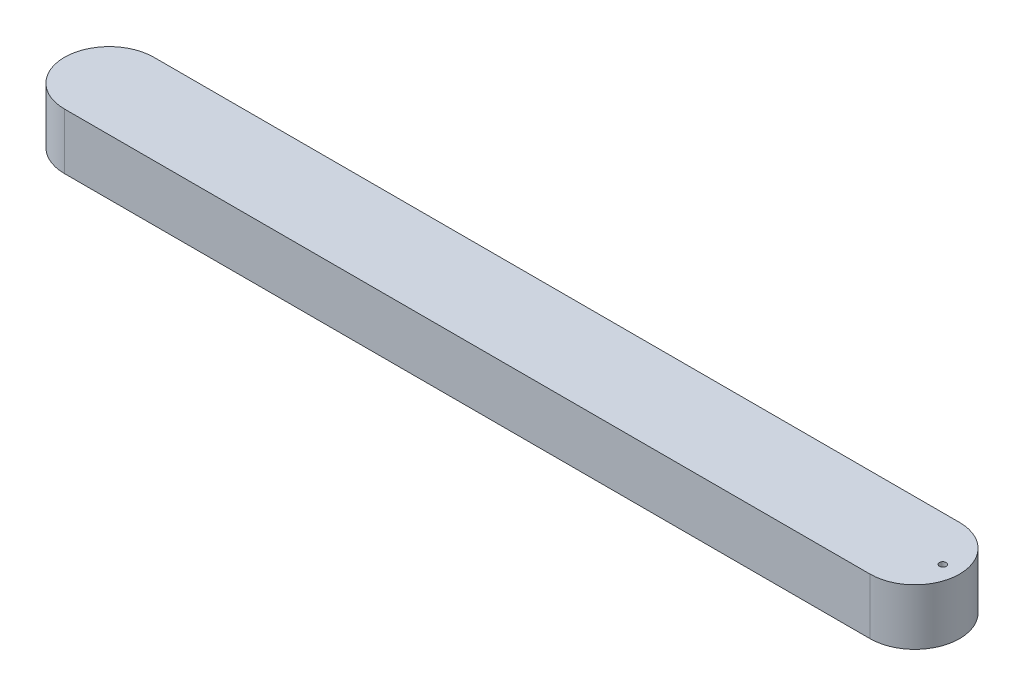
ISO-10303-21;
HEADER;
FILE_DESCRIPTION(('STEP AP214'),'2;1');
FILE_NAME('part.step','',(''),(''),'','','');
FILE_SCHEMA(('AUTOMOTIVE_DESIGN { 1 0 10303 214 1 1 1 1 }'));
ENDSEC;
DATA;
#1=APPLICATION_CONTEXT('core data for automotive mechanical design processes');
#2=APPLICATION_PROTOCOL_DEFINITION('international standard','automotive_design',2000,#1);
#3=PRODUCT_CONTEXT('',#1,'mechanical');
#4=PRODUCT('Part','Part','',(#3));
#5=PRODUCT_RELATED_PRODUCT_CATEGORY('part','',(#4));
#6=PRODUCT_DEFINITION_FORMATION('','',#4);
#7=PRODUCT_DEFINITION_CONTEXT('part definition',#1,'design');
#8=PRODUCT_DEFINITION('design','',#6,#7);
#9=PRODUCT_DEFINITION_SHAPE('','',#8);
#10=(LENGTH_UNIT() NAMED_UNIT(*) SI_UNIT(.MILLI.,.METRE.));
#11=(NAMED_UNIT(*) PLANE_ANGLE_UNIT() SI_UNIT($,.RADIAN.));
#12=(NAMED_UNIT(*) SI_UNIT($,.STERADIAN.) SOLID_ANGLE_UNIT());
#13=UNCERTAINTY_MEASURE_WITH_UNIT(LENGTH_MEASURE(1.E-05),#10,'distance_accuracy_value','');
#14=(GEOMETRIC_REPRESENTATION_CONTEXT(3) GLOBAL_UNCERTAINTY_ASSIGNED_CONTEXT((#13)) GLOBAL_UNIT_ASSIGNED_CONTEXT((#10,
#11,#12)) REPRESENTATION_CONTEXT('',''));
#15=CARTESIAN_POINT('',(0.,0.,0.));
#16=DIRECTION('',(0.,0.,1.));
#17=DIRECTION('',(1.,0.,0.));
#18=AXIS2_PLACEMENT_3D('',#15,#16,#17);
#19=CARTESIAN_POINT('',(0.,10.,0.));
#20=DIRECTION('',(0.,-1.,0.));
#21=DIRECTION('',(0.,0.,-1.));
#22=AXIS2_PLACEMENT_3D('',#19,#20,#21);
#23=PLANE('',#22);
#24=DIRECTION('',(0.,0.,1.));
#25=VECTOR('',#24,1.);
#26=CARTESIAN_POINT('',(360.,10.,0.));
#27=LINE('',#26,#25);
#28=CARTESIAN_POINT('',(360.,10.,22.));
#29=VERTEX_POINT('',#28);
#30=CARTESIAN_POINT('',(360.,10.,23.));
#31=VERTEX_POINT('',#30);
#32=EDGE_CURVE('E11',#29,#31,#27,.T.);
#33=ORIENTED_EDGE('',*,*,#32,.F.);
#34=CARTESIAN_POINT('',(360.,10.,26.));
#35=DIRECTION('',(0.,-1.,0.));
#36=DIRECTION('',(0.,0.,-1.));
#37=AXIS2_PLACEMENT_3D('',#34,#35,#36);
#38=CIRCLE('',#37,4.);
#39=CARTESIAN_POINT('',(360.,10.,30.));
#40=VERTEX_POINT('',#39);
#41=EDGE_CURVE('E277',#29,#40,#38,.T.);
#42=ORIENTED_EDGE('',*,*,#41,.T.);
#43=DIRECTION('',(-1.,0.,0.));
#44=VECTOR('',#43,1.);
#45=CARTESIAN_POINT('',(0.,10.,30.));
#46=LINE('',#45,#44);
#47=CARTESIAN_POINT('',(-360.,10.,29.9999999999999));
#48=VERTEX_POINT('',#47);
#49=EDGE_CURVE('E262',#40,#48,#46,.T.);
#50=ORIENTED_EDGE('',*,*,#49,.T.);
#51=CARTESIAN_POINT('',(-360.,10.,26.));
#52=DIRECTION('',(0.,-1.,0.));
#53=DIRECTION('',(0.,0.,-1.));
#54=AXIS2_PLACEMENT_3D('',#51,#52,#53);
#55=CIRCLE('',#54,3.99999999999996);
#56=CARTESIAN_POINT('',(-360.,10.,22.));
#57=VERTEX_POINT('',#56);
#58=EDGE_CURVE('E265',#48,#57,#55,.T.);
#59=ORIENTED_EDGE('',*,*,#58,.T.);
#60=DIRECTION('',(0.,0.,-1.));
#61=VECTOR('',#60,1.);
#62=CARTESIAN_POINT('',(-360.,10.,0.));
#63=LINE('',#62,#61);
#64=CARTESIAN_POINT('',(-360.,10.,22.9999999999999));
#65=VERTEX_POINT('',#64);
#66=EDGE_CURVE('E380',#65,#57,#63,.T.);
#67=ORIENTED_EDGE('',*,*,#66,.F.);
#68=CARTESIAN_POINT('',(-356.,10.,22.9999999999999));
#69=DIRECTION('',(0.,-1.,0.));
#70=DIRECTION('',(0.,0.,-1.));
#71=AXIS2_PLACEMENT_3D('',#68,#69,#70);
#72=CIRCLE('',#71,4.);
#73=CARTESIAN_POINT('',(-356.,10.,26.9999999999999));
#74=VERTEX_POINT('',#73);
#75=EDGE_CURVE('E205',#74,#65,#72,.T.);
#76=ORIENTED_EDGE('',*,*,#75,.F.);
#77=DIRECTION('',(-1.,0.,0.));
#78=VECTOR('',#77,1.);
#79=CARTESIAN_POINT('',(0.,10.,27.));
#80=LINE('',#79,#78);
#81=CARTESIAN_POINT('',(356.,10.,27.));
#82=VERTEX_POINT('',#81);
#83=EDGE_CURVE('E386',#82,#74,#80,.T.);
#84=ORIENTED_EDGE('',*,*,#83,.F.);
#85=CARTESIAN_POINT('',(356.,10.,23.));
#86=DIRECTION('',(0.,-1.,0.));
#87=DIRECTION('',(0.,0.,-1.));
#88=AXIS2_PLACEMENT_3D('',#85,#86,#87);
#89=CIRCLE('',#88,4.00000000000003);
#90=EDGE_CURVE('E39',#31,#82,#89,.T.);
#91=ORIENTED_EDGE('',*,*,#90,.F.);
#92=EDGE_LOOP('',(#33,#42,#50,#59,#67,#76,#84,#91));
#93=FACE_BOUND('',#92,.T.);
#94=ADVANCED_FACE('F35',(#93),#23,.T.);
#95=CARTESIAN_POINT('',(360.,50.,4.04499180678419E-06));
#96=DIRECTION('',(0.,-1.,0.));
#97=DIRECTION('',(0.,0.,-1.));
#98=AXIS2_PLACEMENT_3D('',#95,#96,#97);
#99=CYLINDRICAL_SURFACE('',#98,39.9999970299869);
#100=CARTESIAN_POINT('',(360.,0.,4.04499180678419E-06));
#101=DIRECTION('',(0.,1.,0.));
#102=DIRECTION('',(0.,0.,-1.));
#103=AXIS2_PLACEMENT_3D('',#100,#101,#102);
#104=CIRCLE('',#103,39.9999970299869);
#105=CARTESIAN_POINT('',(360.,0.,40.));
#106=VERTEX_POINT('',#105);
#107=CARTESIAN_POINT('',(360.,0.,-39.9999940599737));
#108=VERTEX_POINT('',#107);
#109=EDGE_CURVE('E342',#106,#108,#104,.T.);
#110=ORIENTED_EDGE('',*,*,#109,.T.);
#111=DIRECTION('',(0.,-1.,0.));
#112=VECTOR('',#111,1.);
#113=CARTESIAN_POINT('',(360.,50.,-39.9999940599737));
#114=LINE('',#113,#112);
#115=CARTESIAN_POINT('',(360.,50.,-39.9999940599737));
#116=VERTEX_POINT('',#115);
#117=EDGE_CURVE('E374',#116,#108,#114,.T.);
#118=ORIENTED_EDGE('',*,*,#117,.F.);
#119=CARTESIAN_POINT('',(360.,50.,4.04499180678419E-06));
#120=DIRECTION('',(0.,1.,0.));
#121=DIRECTION('',(0.,0.,-1.));
#122=AXIS2_PLACEMENT_3D('',#119,#120,#121);
#123=CIRCLE('',#122,39.9999970299869);
#124=CARTESIAN_POINT('',(360.,50.,40.));
#125=VERTEX_POINT('',#124);
#126=EDGE_CURVE('E348',#125,#116,#123,.T.);
#127=ORIENTED_EDGE('',*,*,#126,.F.);
#128=DIRECTION('',(0.,-1.,0.));
#129=VECTOR('',#128,1.);
#130=CARTESIAN_POINT('',(360.,50.,40.));
#131=LINE('',#130,#129);
#132=EDGE_CURVE('E358',#125,#106,#131,.T.);
#133=ORIENTED_EDGE('',*,*,#132,.T.);
#134=EDGE_LOOP('',(#110,#118,#127,#133));
#135=FACE_BOUND('',#134,.T.);
#136=ADVANCED_FACE('F37',(#135),#99,.T.);
#137=CARTESIAN_POINT('',(-360.,50.,-39.9999940599737));
#138=DIRECTION('',(0.,0.,1.));
#139=DIRECTION('',(1.,0.,0.));
#140=AXIS2_PLACEMENT_3D('',#137,#138,#139);
#141=PLANE('',#140);
#142=DIRECTION('',(-1.,0.,0.));
#143=VECTOR('',#142,1.);
#144=CARTESIAN_POINT('',(-360.,0.,-39.9999940599737));
#145=LINE('',#144,#143);
#146=CARTESIAN_POINT('',(-360.,0.,-39.9999910899606));
#147=VERTEX_POINT('',#146);
#148=EDGE_CURVE('E361',#108,#147,#145,.T.);
#149=ORIENTED_EDGE('',*,*,#148,.T.);
#150=DIRECTION('',(0.,-1.,0.));
#151=VECTOR('',#150,1.);
#152=CARTESIAN_POINT('',(-360.,50.,-39.9999910899606));
#153=LINE('',#152,#151);
#154=CARTESIAN_POINT('',(-360.,50.,-39.9999910899606));
#155=VERTEX_POINT('',#154);
#156=EDGE_CURVE('E371',#155,#147,#153,.T.);
#157=ORIENTED_EDGE('',*,*,#156,.F.);
#158=DIRECTION('',(-1.,0.,0.));
#159=VECTOR('',#158,1.);
#160=CARTESIAN_POINT('',(-360.,50.,-39.9999940599737));
#161=LINE('',#160,#159);
#162=EDGE_CURVE('E351',#116,#155,#161,.T.);
#163=ORIENTED_EDGE('',*,*,#162,.F.);
#164=ORIENTED_EDGE('',*,*,#117,.T.);
#165=EDGE_LOOP('',(#149,#157,#163,#164));
#166=FACE_BOUND('',#165,.T.);
#167=ADVANCED_FACE('F451',(#166),#141,.F.);
#168=CARTESIAN_POINT('',(-360.,50.,5.94002628334644E-06));
#169=DIRECTION('',(0.,-1.,0.));
#170=DIRECTION('',(0.,0.,-1.));
#171=AXIS2_PLACEMENT_3D('',#168,#169,#170);
#172=CYLINDRICAL_SURFACE('',#171,39.9999970299869);
#173=CARTESIAN_POINT('',(-360.,0.,5.94002628334644E-06));
#174=DIRECTION('',(0.,1.,0.));
#175=DIRECTION('',(0.,0.,-1.));
#176=AXIS2_PLACEMENT_3D('',#173,#174,#175);
#177=CIRCLE('',#176,39.9999970299869);
#178=CARTESIAN_POINT('',(-360.,0.,40.));
#179=VERTEX_POINT('',#178);
#180=EDGE_CURVE('E363',#147,#179,#177,.T.);
#181=ORIENTED_EDGE('',*,*,#180,.T.);
#182=DIRECTION('',(0.,-1.,0.));
#183=VECTOR('',#182,1.);
#184=CARTESIAN_POINT('',(-360.,50.,40.));
#185=LINE('',#184,#183);
#186=CARTESIAN_POINT('',(-360.,50.,40.));
#187=VERTEX_POINT('',#186);
#188=EDGE_CURVE('E368',#187,#179,#185,.T.);
#189=ORIENTED_EDGE('',*,*,#188,.F.);
#190=CARTESIAN_POINT('',(-360.,50.,5.94002628334644E-06));
#191=DIRECTION('',(0.,1.,0.));
#192=DIRECTION('',(0.,0.,-1.));
#193=AXIS2_PLACEMENT_3D('',#190,#191,#192);
#194=CIRCLE('',#193,39.9999970299869);
#195=EDGE_CURVE('E354',#155,#187,#194,.T.);
#196=ORIENTED_EDGE('',*,*,#195,.F.);
#197=ORIENTED_EDGE('',*,*,#156,.T.);
#198=EDGE_LOOP('',(#181,#189,#196,#197));
#199=FACE_BOUND('',#198,.T.);
#200=ADVANCED_FACE('F615',(#199),#172,.T.);
#201=CARTESIAN_POINT('',(-360.,50.,40.));
#202=DIRECTION('',(0.,0.,-1.));
#203=DIRECTION('',(-1.,0.,0.));
#204=AXIS2_PLACEMENT_3D('',#201,#202,#203);
#205=PLANE('',#204);
#206=DIRECTION('',(1.,0.,0.));
#207=VECTOR('',#206,1.);
#208=CARTESIAN_POINT('',(-360.,0.,40.));
#209=LINE('',#208,#207);
#210=EDGE_CURVE('E352',#179,#106,#209,.T.);
#211=ORIENTED_EDGE('',*,*,#210,.T.);
#212=ORIENTED_EDGE('',*,*,#132,.F.);
#213=DIRECTION('',(1.,0.,0.));
#214=VECTOR('',#213,1.);
#215=CARTESIAN_POINT('',(-360.,50.,40.));
#216=LINE('',#215,#214);
#217=EDGE_CURVE('E356',#187,#125,#216,.T.);
#218=ORIENTED_EDGE('',*,*,#217,.F.);
#219=ORIENTED_EDGE('',*,*,#188,.T.);
#220=EDGE_LOOP('',(#211,#212,#218,#219));
#221=FACE_BOUND('',#220,.T.);
#222=ADVANCED_FACE('F574',(#221),#205,.F.);
#223=CARTESIAN_POINT('',(360.,50.,4.04499180678419E-06));
#224=DIRECTION('',(0.,-1.,0.));
#225=DIRECTION('',(0.,0.,-1.));
#226=AXIS2_PLACEMENT_3D('',#223,#224,#225);
#227=PLANE('',#226);
#228=CARTESIAN_POINT('',(385.,50.,0.));
#229=DIRECTION('',(0.,-1.,0.));
#230=DIRECTION('',(0.,0.,-1.));
#231=AXIS2_PLACEMENT_3D('',#228,#229,#230);
#232=CIRCLE('',#231,3.);
#233=CARTESIAN_POINT('',(385.,50.,-3.));
#234=VERTEX_POINT('',#233);
#235=EDGE_CURVE('E224',#234,#234,#232,.T.);
#236=ORIENTED_EDGE('',*,*,#235,.T.);
#237=EDGE_LOOP('',(#236));
#238=FACE_BOUND('',#237,.T.);
#239=ORIENTED_EDGE('',*,*,#126,.T.);
#240=ORIENTED_EDGE('',*,*,#162,.T.);
#241=ORIENTED_EDGE('',*,*,#195,.T.);
#242=ORIENTED_EDGE('',*,*,#217,.T.);
#243=EDGE_LOOP('',(#239,#240,#241,#242));
#244=FACE_BOUND('',#243,.T.);
#245=ADVANCED_FACE('F568',(#238,#244),#227,.F.);
#246=CARTESIAN_POINT('',(360.,0.,4.04499180678419E-06));
#247=DIRECTION('',(0.,-1.,0.));
#248=DIRECTION('',(0.,0.,-1.));
#249=AXIS2_PLACEMENT_3D('',#246,#247,#248);
#250=PLANE('',#249);
#251=CARTESIAN_POINT('',(-360.,0.,5.94002628334644E-06));
#252=DIRECTION('',(0.,-1.,0.));
#253=DIRECTION('',(0.,0.,-1.));
#254=AXIS2_PLACEMENT_3D('',#251,#252,#253);
#255=CIRCLE('',#254,34.9999955449803);
#256=CARTESIAN_POINT('',(-360.,0.,35.0000014850066));
#257=VERTEX_POINT('',#256);
#258=CARTESIAN_POINT('',(-360.,0.,-34.999989604954));
#259=VERTEX_POINT('',#258);
#260=EDGE_CURVE('E60',#257,#259,#255,.T.);
#261=ORIENTED_EDGE('',*,*,#260,.F.);
#262=DIRECTION('',(-1.,0.,5.69483224080767E-10));
#263=VECTOR('',#262,1.);
#264=CARTESIAN_POINT('',(360.,0.,35.0000010749787));
#265=LINE('',#264,#263);
#266=CARTESIAN_POINT('',(360.,0.,35.0000010749787));
#267=VERTEX_POINT('',#266);
#268=EDGE_CURVE('E321',#267,#257,#265,.T.);
#269=ORIENTED_EDGE('',*,*,#268,.F.);
#270=CARTESIAN_POINT('',(360.,0.,4.04499180678419E-06));
#271=DIRECTION('',(0.,-1.,0.));
#272=DIRECTION('',(0.,0.,-1.));
#273=AXIS2_PLACEMENT_3D('',#270,#271,#272);
#274=CIRCLE('',#273,34.9999975674762);
#275=CARTESIAN_POINT('',(360.000000020625,0.,-34.9999935224844));
#276=VERTEX_POINT('',#275);
#277=EDGE_CURVE('E335',#276,#267,#274,.T.);
#278=ORIENTED_EDGE('',*,*,#277,.F.);
#279=DIRECTION('',(1.,0.,-6.18752734216856E-09));
#280=VECTOR('',#279,1.);
#281=CARTESIAN_POINT('',(-360.,0.,-34.999989604954));
#282=LINE('',#281,#280);
#283=EDGE_CURVE('E332',#259,#276,#282,.T.);
#284=ORIENTED_EDGE('',*,*,#283,.F.);
#285=EDGE_LOOP('',(#261,#269,#278,#284));
#286=FACE_BOUND('',#285,.T.);
#287=ORIENTED_EDGE('',*,*,#109,.F.);
#288=ORIENTED_EDGE('',*,*,#210,.F.);
#289=ORIENTED_EDGE('',*,*,#180,.F.);
#290=ORIENTED_EDGE('',*,*,#148,.F.);
#291=EDGE_LOOP('',(#287,#288,#289,#290));
#292=FACE_BOUND('',#291,.T.);
#293=ADVANCED_FACE('F573',(#286,#292),#250,.T.);
#294=CARTESIAN_POINT('',(-360.,4.,5.94002628334644E-06));
#295=DIRECTION('',(0.,-1.,0.));
#296=DIRECTION('',(0.,0.,-1.));
#297=AXIS2_PLACEMENT_3D('',#294,#295,#296);
#298=CYLINDRICAL_SURFACE('',#297,34.9999955449803);
#299=ORIENTED_EDGE('',*,*,#260,.T.);
#300=DIRECTION('',(0.,-1.,0.));
#301=VECTOR('',#300,1.);
#302=CARTESIAN_POINT('',(-360.,4.,-34.999989604954));
#303=LINE('',#302,#301);
#304=CARTESIAN_POINT('',(-360.,4.,-34.999989604954));
#305=VERTEX_POINT('',#304);
#306=EDGE_CURVE('E330',#305,#259,#303,.T.);
#307=ORIENTED_EDGE('',*,*,#306,.F.);
#308=CARTESIAN_POINT('',(-360.,4.,5.94002628334644E-06));
#309=DIRECTION('',(0.,-1.,0.));
#310=DIRECTION('',(0.,0.,-1.));
#311=AXIS2_PLACEMENT_3D('',#308,#309,#310);
#312=CIRCLE('',#311,34.9999955449803);
#313=CARTESIAN_POINT('',(-360.,4.,35.0000014850066));
#314=VERTEX_POINT('',#313);
#315=EDGE_CURVE('E317',#314,#305,#312,.T.);
#316=ORIENTED_EDGE('',*,*,#315,.F.);
#317=DIRECTION('',(0.,-1.,0.));
#318=VECTOR('',#317,1.);
#319=CARTESIAN_POINT('',(-360.,4.,35.0000014850066));
#320=LINE('',#319,#318);
#321=EDGE_CURVE('E340',#314,#257,#320,.T.);
#322=ORIENTED_EDGE('',*,*,#321,.T.);
#323=EDGE_LOOP('',(#299,#307,#316,#322));
#324=FACE_BOUND('',#323,.T.);
#325=ADVANCED_FACE('F619',(#324),#298,.F.);
#326=CARTESIAN_POINT('',(360.,4.,35.0000010749787));
#327=DIRECTION('',(5.69483224080767E-10,0.,1.));
#328=DIRECTION('',(1.,0.,-5.69483224080767E-10));
#329=AXIS2_PLACEMENT_3D('',#326,#327,#328);
#330=PLANE('',#329);
#331=ORIENTED_EDGE('',*,*,#268,.T.);
#332=ORIENTED_EDGE('',*,*,#321,.F.);
#333=DIRECTION('',(-1.,0.,5.69483224080767E-10));
#334=VECTOR('',#333,1.);
#335=CARTESIAN_POINT('',(360.,4.,35.0000010749787));
#336=LINE('',#335,#334);
#337=CARTESIAN_POINT('',(360.,4.,35.0000010749787));
#338=VERTEX_POINT('',#337);
#339=EDGE_CURVE('E327',#338,#314,#336,.T.);
#340=ORIENTED_EDGE('',*,*,#339,.F.);
#341=DIRECTION('',(0.,-1.,0.));
#342=VECTOR('',#341,1.);
#343=CARTESIAN_POINT('',(360.,4.,35.0000010749787));
#344=LINE('',#343,#342);
#345=EDGE_CURVE('E343',#338,#267,#344,.T.);
#346=ORIENTED_EDGE('',*,*,#345,.T.);
#347=EDGE_LOOP('',(#331,#332,#340,#346));
#348=FACE_BOUND('',#347,.T.);
#349=ADVANCED_FACE('F625',(#348),#330,.F.);
#350=CARTESIAN_POINT('',(360.,4.,4.04499180678419E-06));
#351=DIRECTION('',(0.,-1.,0.));
#352=DIRECTION('',(0.,0.,-1.));
#353=AXIS2_PLACEMENT_3D('',#350,#351,#352);
#354=CYLINDRICAL_SURFACE('',#353,34.9999975674762);
#355=ORIENTED_EDGE('',*,*,#277,.T.);
#356=ORIENTED_EDGE('',*,*,#345,.F.);
#357=CARTESIAN_POINT('',(360.,4.,4.04499180678419E-06));
#358=DIRECTION('',(0.,-1.,0.));
#359=DIRECTION('',(0.,0.,-1.));
#360=AXIS2_PLACEMENT_3D('',#357,#358,#359);
#361=CIRCLE('',#360,34.9999975674762);
#362=CARTESIAN_POINT('',(360.000000020625,4.,-34.9999935224844));
#363=VERTEX_POINT('',#362);
#364=EDGE_CURVE('E324',#363,#338,#361,.T.);
#365=ORIENTED_EDGE('',*,*,#364,.F.);
#366=DIRECTION('',(0.,-1.,0.));
#367=VECTOR('',#366,1.);
#368=CARTESIAN_POINT('',(360.000000020625,4.,-34.9999935224844));
#369=LINE('',#368,#367);
#370=EDGE_CURVE('E345',#363,#276,#369,.T.);
#371=ORIENTED_EDGE('',*,*,#370,.T.);
#372=EDGE_LOOP('',(#355,#356,#365,#371));
#373=FACE_BOUND('',#372,.T.);
#374=ADVANCED_FACE('F660',(#373),#354,.F.);
#375=CARTESIAN_POINT('',(-360.,4.,-34.999989604954));
#376=DIRECTION('',(-6.18752734216856E-09,0.,-1.));
#377=DIRECTION('',(-1.,0.,6.18752734216856E-09));
#378=AXIS2_PLACEMENT_3D('',#375,#376,#377);
#379=PLANE('',#378);
#380=ORIENTED_EDGE('',*,*,#283,.T.);
#381=ORIENTED_EDGE('',*,*,#370,.F.);
#382=DIRECTION('',(1.,0.,-6.18752734216856E-09));
#383=VECTOR('',#382,1.);
#384=CARTESIAN_POINT('',(-360.,4.,-34.999989604954));
#385=LINE('',#384,#383);
#386=EDGE_CURVE('E320',#305,#363,#385,.T.);
#387=ORIENTED_EDGE('',*,*,#386,.F.);
#388=ORIENTED_EDGE('',*,*,#306,.T.);
#389=EDGE_LOOP('',(#380,#381,#387,#388));
#390=FACE_BOUND('',#389,.T.);
#391=ADVANCED_FACE('F442',(#390),#379,.F.);
#392=CARTESIAN_POINT('',(-360.,4.,5.94002628334644E-06));
#393=DIRECTION('',(0.,-1.,0.));
#394=DIRECTION('',(0.,0.,-1.));
#395=AXIS2_PLACEMENT_3D('',#392,#393,#394);
#396=PLANE('',#395);
#397=CARTESIAN_POINT('',(385.,4.,0.));
#398=DIRECTION('',(0.,-1.,0.));
#399=DIRECTION('',(0.,0.,-1.));
#400=AXIS2_PLACEMENT_3D('',#397,#398,#399);
#401=CIRCLE('',#400,3.);
#402=CARTESIAN_POINT('',(385.,4.,-3.));
#403=VERTEX_POINT('',#402);
#404=EDGE_CURVE('E227',#403,#403,#401,.T.);
#405=ORIENTED_EDGE('',*,*,#404,.F.);
#406=EDGE_LOOP('',(#405));
#407=FACE_BOUND('',#406,.T.);
#408=DIRECTION('',(-1.,0.,0.));
#409=VECTOR('',#408,1.);
#410=CARTESIAN_POINT('',(0.,4.,30.));
#411=LINE('',#410,#409);
#412=CARTESIAN_POINT('',(360.,4.,30.));
#413=VERTEX_POINT('',#412);
#414=CARTESIAN_POINT('',(-360.,4.,30.));
#415=VERTEX_POINT('',#414);
#416=EDGE_CURVE('E52',#413,#415,#411,.T.);
#417=ORIENTED_EDGE('',*,*,#416,.F.);
#418=CARTESIAN_POINT('',(360.,4.,26.));
#419=DIRECTION('',(0.,-1.,0.));
#420=DIRECTION('',(0.,0.,-1.));
#421=AXIS2_PLACEMENT_3D('',#418,#419,#420);
#422=CIRCLE('',#421,4.);
#423=CARTESIAN_POINT('',(360.,4.,22.));
#424=VERTEX_POINT('',#423);
#425=EDGE_CURVE('E266',#424,#413,#422,.T.);
#426=ORIENTED_EDGE('',*,*,#425,.F.);
#427=DIRECTION('',(0.,0.,1.));
#428=VECTOR('',#427,1.);
#429=CARTESIAN_POINT('',(360.,4.,0.));
#430=LINE('',#429,#428);
#431=CARTESIAN_POINT('',(360.,4.,-22.));
#432=VERTEX_POINT('',#431);
#433=EDGE_CURVE('E297',#432,#424,#430,.T.);
#434=ORIENTED_EDGE('',*,*,#433,.F.);
#435=CARTESIAN_POINT('',(360.,4.,-26.));
#436=DIRECTION('',(0.,-1.,0.));
#437=DIRECTION('',(0.,0.,-1.));
#438=AXIS2_PLACEMENT_3D('',#435,#436,#437);
#439=CIRCLE('',#438,4.);
#440=CARTESIAN_POINT('',(360.,4.,-30.));
#441=VERTEX_POINT('',#440);
#442=EDGE_CURVE('E294',#441,#432,#439,.T.);
#443=ORIENTED_EDGE('',*,*,#442,.F.);
#444=DIRECTION('',(-1.,0.,0.));
#445=VECTOR('',#444,1.);
#446=CARTESIAN_POINT('',(0.,4.,-30.));
#447=LINE('',#446,#445);
#448=CARTESIAN_POINT('',(-360.,4.,-30.0000000000001));
#449=VERTEX_POINT('',#448);
#450=EDGE_CURVE('E291',#441,#449,#447,.T.);
#451=ORIENTED_EDGE('',*,*,#450,.T.);
#452=CARTESIAN_POINT('',(-360.,4.,-26.0000000000001));
#453=DIRECTION('',(0.,-1.,0.));
#454=DIRECTION('',(0.,0.,-1.));
#455=AXIS2_PLACEMENT_3D('',#452,#453,#454);
#456=CIRCLE('',#455,4.);
#457=CARTESIAN_POINT('',(-360.,4.,-22.0000000000001));
#458=VERTEX_POINT('',#457);
#459=EDGE_CURVE('E288',#449,#458,#456,.F.);
#460=ORIENTED_EDGE('',*,*,#459,.T.);
#461=DIRECTION('',(0.,0.,1.));
#462=VECTOR('',#461,1.);
#463=CARTESIAN_POINT('',(-360.,4.,4.54182146437563E-13));
#464=LINE('',#463,#462);
#465=CARTESIAN_POINT('',(-360.,4.,22.));
#466=VERTEX_POINT('',#465);
#467=EDGE_CURVE('E285',#458,#466,#464,.T.);
#468=ORIENTED_EDGE('',*,*,#467,.T.);
#469=CARTESIAN_POINT('',(-360.,4.,26.));
#470=DIRECTION('',(0.,-1.,0.));
#471=DIRECTION('',(0.,0.,-1.));
#472=AXIS2_PLACEMENT_3D('',#469,#470,#471);
#473=CIRCLE('',#472,3.99999999999996);
#474=EDGE_CURVE('E282',#415,#466,#473,.T.);
#475=ORIENTED_EDGE('',*,*,#474,.F.);
#476=EDGE_LOOP('',(#417,#426,#434,#443,#451,#460,#468,#475));
#477=FACE_BOUND('',#476,.T.);
#478=ORIENTED_EDGE('',*,*,#315,.T.);
#479=ORIENTED_EDGE('',*,*,#386,.T.);
#480=ORIENTED_EDGE('',*,*,#364,.T.);
#481=ORIENTED_EDGE('',*,*,#339,.T.);
#482=EDGE_LOOP('',(#478,#479,#480,#481));
#483=FACE_BOUND('',#482,.T.);
#484=ADVANCED_FACE('F401',(#407,#477,#483),#396,.T.);
#485=CARTESIAN_POINT('',(0.,10.,30.));
#486=DIRECTION('',(0.,0.,1.));
#487=DIRECTION('',(1.,0.,0.));
#488=AXIS2_PLACEMENT_3D('',#485,#486,#487);
#489=PLANE('',#488);
#490=ORIENTED_EDGE('',*,*,#416,.T.);
#491=DIRECTION('',(0.,-1.,0.));
#492=VECTOR('',#491,1.);
#493=CARTESIAN_POINT('',(-360.,10.,29.9999999999999));
#494=LINE('',#493,#492);
#495=EDGE_CURVE('E280',#48,#415,#494,.T.);
#496=ORIENTED_EDGE('',*,*,#495,.F.);
#497=ORIENTED_EDGE('',*,*,#49,.F.);
#498=DIRECTION('',(0.,-1.,0.));
#499=VECTOR('',#498,1.);
#500=CARTESIAN_POINT('',(360.,10.,30.));
#501=LINE('',#500,#499);
#502=EDGE_CURVE('E302',#40,#413,#501,.T.);
#503=ORIENTED_EDGE('',*,*,#502,.T.);
#504=EDGE_LOOP('',(#490,#496,#497,#503));
#505=FACE_BOUND('',#504,.T.);
#506=ADVANCED_FACE('F434',(#505),#489,.F.);
#507=CARTESIAN_POINT('',(360.,10.,26.));
#508=DIRECTION('',(0.,-1.,0.));
#509=DIRECTION('',(0.,0.,-1.));
#510=AXIS2_PLACEMENT_3D('',#507,#508,#509);
#511=CYLINDRICAL_SURFACE('',#510,4.);
#512=ORIENTED_EDGE('',*,*,#425,.T.);
#513=ORIENTED_EDGE('',*,*,#502,.F.);
#514=ORIENTED_EDGE('',*,*,#41,.F.);
#515=DIRECTION('',(0.,-1.,0.));
#516=VECTOR('',#515,1.);
#517=CARTESIAN_POINT('',(360.,10.,22.));
#518=LINE('',#517,#516);
#519=EDGE_CURVE('E304',#29,#424,#518,.T.);
#520=ORIENTED_EDGE('',*,*,#519,.T.);
#521=EDGE_LOOP('',(#512,#513,#514,#520));
#522=FACE_BOUND('',#521,.T.);
#523=ADVANCED_FACE('F432',(#522),#511,.F.);
#524=CARTESIAN_POINT('',(360.,10.,0.));
#525=DIRECTION('',(1.,0.,0.));
#526=DIRECTION('',(0.,0.,-1.));
#527=AXIS2_PLACEMENT_3D('',#524,#525,#526);
#528=PLANE('',#527);
#529=ORIENTED_EDGE('',*,*,#433,.T.);
#530=ORIENTED_EDGE('',*,*,#519,.F.);
#531=ORIENTED_EDGE('',*,*,#32,.T.);
#532=DIRECTION('',(0.,-1.,0.));
#533=VECTOR('',#532,1.);
#534=CARTESIAN_POINT('',(360.,34.,23.));
#535=LINE('',#534,#533);
#536=CARTESIAN_POINT('',(360.,34.,23.));
#537=VERTEX_POINT('',#536);
#538=EDGE_CURVE('E249',#537,#31,#535,.T.);
#539=ORIENTED_EDGE('',*,*,#538,.F.);
#540=DIRECTION('',(0.,0.,1.));
#541=VECTOR('',#540,1.);
#542=CARTESIAN_POINT('',(360.,34.,-22.9999940599737));
#543=LINE('',#542,#541);
#544=CARTESIAN_POINT('',(360.,34.,-22.9999940599737));
#545=VERTEX_POINT('',#544);
#546=EDGE_CURVE('E238',#545,#537,#543,.T.);
#547=ORIENTED_EDGE('',*,*,#546,.F.);
#548=DIRECTION('',(0.,-1.,0.));
#549=VECTOR('',#548,1.);
#550=CARTESIAN_POINT('',(360.,34.,-22.9999940599737));
#551=LINE('',#550,#549);
#552=CARTESIAN_POINT('',(360.,10.,-22.9999940599737));
#553=VERTEX_POINT('',#552);
#554=EDGE_CURVE('E252',#545,#553,#551,.T.);
#555=ORIENTED_EDGE('',*,*,#554,.T.);
#556=CARTESIAN_POINT('',(360.,10.,-22.));
#557=VERTEX_POINT('',#556);
#558=EDGE_CURVE('E45',#553,#557,#27,.T.);
#559=ORIENTED_EDGE('',*,*,#558,.T.);
#560=DIRECTION('',(0.,-1.,0.));
#561=VECTOR('',#560,1.);
#562=CARTESIAN_POINT('',(360.,10.,-22.));
#563=LINE('',#562,#561);
#564=EDGE_CURVE('E306',#557,#432,#563,.T.);
#565=ORIENTED_EDGE('',*,*,#564,.T.);
#566=EDGE_LOOP('',(#529,#530,#531,#539,#547,#555,#559,#565));
#567=FACE_BOUND('',#566,.T.);
#568=ADVANCED_FACE('F427',(#567),#528,.F.);
#569=CARTESIAN_POINT('',(360.,10.,-26.));
#570=DIRECTION('',(0.,-1.,0.));
#571=DIRECTION('',(0.,0.,-1.));
#572=AXIS2_PLACEMENT_3D('',#569,#570,#571);
#573=CYLINDRICAL_SURFACE('',#572,4.);
#574=ORIENTED_EDGE('',*,*,#442,.T.);
#575=ORIENTED_EDGE('',*,*,#564,.F.);
#576=CARTESIAN_POINT('',(360.,10.,-26.));
#577=DIRECTION('',(0.,-1.,0.));
#578=DIRECTION('',(0.,0.,-1.));
#579=AXIS2_PLACEMENT_3D('',#576,#577,#578);
#580=CIRCLE('',#579,4.);
#581=CARTESIAN_POINT('',(360.,10.,-30.));
#582=VERTEX_POINT('',#581);
#583=EDGE_CURVE('E274',#582,#557,#580,.T.);
#584=ORIENTED_EDGE('',*,*,#583,.F.);
#585=DIRECTION('',(0.,-1.,0.));
#586=VECTOR('',#585,1.);
#587=CARTESIAN_POINT('',(360.,10.,-30.));
#588=LINE('',#587,#586);
#589=EDGE_CURVE('E308',#582,#441,#588,.T.);
#590=ORIENTED_EDGE('',*,*,#589,.T.);
#591=EDGE_LOOP('',(#574,#575,#584,#590));
#592=FACE_BOUND('',#591,.T.);
#593=ADVANCED_FACE('F469',(#592),#573,.F.);
#594=CARTESIAN_POINT('',(0.,10.,-30.));
#595=DIRECTION('',(0.,0.,1.));
#596=DIRECTION('',(1.,0.,0.));
#597=AXIS2_PLACEMENT_3D('',#594,#595,#596);
#598=PLANE('',#597);
#599=ORIENTED_EDGE('',*,*,#450,.F.);
#600=ORIENTED_EDGE('',*,*,#589,.F.);
#601=DIRECTION('',(-1.,0.,0.));
#602=VECTOR('',#601,1.);
#603=CARTESIAN_POINT('',(0.,10.,-30.));
#604=LINE('',#603,#602);
#605=CARTESIAN_POINT('',(-360.,10.,-30.0000000000001));
#606=VERTEX_POINT('',#605);
#607=EDGE_CURVE('E272',#582,#606,#604,.T.);
#608=ORIENTED_EDGE('',*,*,#607,.T.);
#609=DIRECTION('',(0.,-1.,0.));
#610=VECTOR('',#609,1.);
#611=CARTESIAN_POINT('',(-360.,10.,-30.0000000000001));
#612=LINE('',#611,#610);
#613=EDGE_CURVE('E310',#606,#449,#612,.T.);
#614=ORIENTED_EDGE('',*,*,#613,.T.);
#615=EDGE_LOOP('',(#599,#600,#608,#614));
#616=FACE_BOUND('',#615,.T.);
#617=ADVANCED_FACE('F466',(#616),#598,.T.);
#618=CARTESIAN_POINT('',(-360.,10.,-26.0000000000001));
#619=DIRECTION('',(0.,-1.,0.));
#620=DIRECTION('',(0.,0.,-1.));
#621=AXIS2_PLACEMENT_3D('',#618,#619,#620);
#622=CYLINDRICAL_SURFACE('',#621,4.);
#623=ORIENTED_EDGE('',*,*,#459,.F.);
#624=ORIENTED_EDGE('',*,*,#613,.F.);
#625=CARTESIAN_POINT('',(-360.,10.,-26.0000000000001));
#626=DIRECTION('',(0.,-1.,0.));
#627=DIRECTION('',(0.,0.,-1.));
#628=AXIS2_PLACEMENT_3D('',#625,#626,#627);
#629=CIRCLE('',#628,4.);
#630=CARTESIAN_POINT('',(-360.,10.,-22.0000000000001));
#631=VERTEX_POINT('',#630);
#632=EDGE_CURVE('E269',#606,#631,#629,.F.);
#633=ORIENTED_EDGE('',*,*,#632,.T.);
#634=DIRECTION('',(0.,-1.,0.));
#635=VECTOR('',#634,1.);
#636=CARTESIAN_POINT('',(-360.,10.,-22.0000000000001));
#637=LINE('',#636,#635);
#638=EDGE_CURVE('E312',#631,#458,#637,.T.);
#639=ORIENTED_EDGE('',*,*,#638,.T.);
#640=EDGE_LOOP('',(#623,#624,#633,#639));
#641=FACE_BOUND('',#640,.T.);
#642=ADVANCED_FACE('F406',(#641),#622,.F.);
#643=CARTESIAN_POINT('',(-360.,10.,4.54182146437563E-13));
#644=DIRECTION('',(1.,0.,0.));
#645=DIRECTION('',(0.,0.,-1.));
#646=AXIS2_PLACEMENT_3D('',#643,#644,#645);
#647=PLANE('',#646);
#648=ORIENTED_EDGE('',*,*,#467,.F.);
#649=ORIENTED_EDGE('',*,*,#638,.F.);
#650=CARTESIAN_POINT('',(-360.,10.,-22.9999940599738));
#651=VERTEX_POINT('',#650);
#652=EDGE_CURVE('E377',#631,#651,#63,.T.);
#653=ORIENTED_EDGE('',*,*,#652,.T.);
#654=DIRECTION('',(0.,-1.,0.));
#655=VECTOR('',#654,1.);
#656=CARTESIAN_POINT('',(-360.,34.,-22.9999940599738));
#657=LINE('',#656,#655);
#658=CARTESIAN_POINT('',(-360.,34.,-22.9999940599738));
#659=VERTEX_POINT('',#658);
#660=EDGE_CURVE('E208',#659,#651,#657,.T.);
#661=ORIENTED_EDGE('',*,*,#660,.F.);
#662=DIRECTION('',(0.,0.,-1.));
#663=VECTOR('',#662,1.);
#664=CARTESIAN_POINT('',(-360.,34.,-22.9999940599738));
#665=LINE('',#664,#663);
#666=CARTESIAN_POINT('',(-360.,34.,22.9999999999999));
#667=VERTEX_POINT('',#666);
#668=EDGE_CURVE('E212',#667,#659,#665,.T.);
#669=ORIENTED_EDGE('',*,*,#668,.F.);
#670=DIRECTION('',(0.,-1.,0.));
#671=VECTOR('',#670,1.);
#672=CARTESIAN_POINT('',(-360.,34.,22.9999999999999));
#673=LINE('',#672,#671);
#674=EDGE_CURVE('E197',#667,#65,#673,.T.);
#675=ORIENTED_EDGE('',*,*,#674,.T.);
#676=ORIENTED_EDGE('',*,*,#66,.T.);
#677=DIRECTION('',(0.,-1.,0.));
#678=VECTOR('',#677,1.);
#679=CARTESIAN_POINT('',(-360.,10.,22.));
#680=LINE('',#679,#678);
#681=EDGE_CURVE('E314',#57,#466,#680,.T.);
#682=ORIENTED_EDGE('',*,*,#681,.T.);
#683=EDGE_LOOP('',(#648,#649,#653,#661,#669,#675,#676,#682));
#684=FACE_BOUND('',#683,.T.);
#685=ADVANCED_FACE('F214',(#684),#647,.T.);
#686=CARTESIAN_POINT('',(-360.,10.,26.));
#687=DIRECTION('',(0.,-1.,0.));
#688=DIRECTION('',(0.,0.,-1.));
#689=AXIS2_PLACEMENT_3D('',#686,#687,#688);
#690=CYLINDRICAL_SURFACE('',#689,3.99999999999996);
#691=ORIENTED_EDGE('',*,*,#474,.T.);
#692=ORIENTED_EDGE('',*,*,#681,.F.);
#693=ORIENTED_EDGE('',*,*,#58,.F.);
#694=ORIENTED_EDGE('',*,*,#495,.T.);
#695=EDGE_LOOP('',(#691,#692,#693,#694));
#696=FACE_BOUND('',#695,.T.);
#697=ADVANCED_FACE('F398',(#696),#690,.F.);
#698=ORIENTED_EDGE('',*,*,#558,.F.);
#699=CARTESIAN_POINT('',(356.,10.,-22.9999940599737));
#700=DIRECTION('',(0.,-1.,0.));
#701=DIRECTION('',(0.,0.,-1.));
#702=AXIS2_PLACEMENT_3D('',#699,#700,#701);
#703=CIRCLE('',#702,4.00000000000003);
#704=CARTESIAN_POINT('',(356.,10.,-26.9999940599737));
#705=VERTEX_POINT('',#704);
#706=EDGE_CURVE('E384',#705,#553,#703,.T.);
#707=ORIENTED_EDGE('',*,*,#706,.F.);
#708=DIRECTION('',(1.,0.,0.));
#709=VECTOR('',#708,1.);
#710=CARTESIAN_POINT('',(0.,10.,-26.9999940599737));
#711=LINE('',#710,#709);
#712=CARTESIAN_POINT('',(-356.,10.,-26.9999940599738));
#713=VERTEX_POINT('',#712);
#714=EDGE_CURVE('E382',#713,#705,#711,.T.);
#715=ORIENTED_EDGE('',*,*,#714,.F.);
#716=CARTESIAN_POINT('',(-356.,10.,-22.9999940599738));
#717=DIRECTION('',(0.,-1.,0.));
#718=DIRECTION('',(0.,0.,-1.));
#719=AXIS2_PLACEMENT_3D('',#716,#717,#718);
#720=CIRCLE('',#719,4.);
#721=EDGE_CURVE('E379',#651,#713,#720,.T.);
#722=ORIENTED_EDGE('',*,*,#721,.F.);
#723=ORIENTED_EDGE('',*,*,#652,.F.);
#724=ORIENTED_EDGE('',*,*,#632,.F.);
#725=ORIENTED_EDGE('',*,*,#607,.F.);
#726=ORIENTED_EDGE('',*,*,#583,.T.);
#727=EDGE_LOOP('',(#698,#707,#715,#722,#723,#724,#725,#726));
#728=FACE_BOUND('',#727,.T.);
#729=ADVANCED_FACE('F412',(#728),#23,.T.);
#730=CARTESIAN_POINT('',(-356.,34.,22.9999999999999));
#731=DIRECTION('',(0.,-1.,0.));
#732=DIRECTION('',(0.,0.,-1.));
#733=AXIS2_PLACEMENT_3D('',#730,#731,#732);
#734=CYLINDRICAL_SURFACE('',#733,4.);
#735=ORIENTED_EDGE('',*,*,#75,.T.);
#736=ORIENTED_EDGE('',*,*,#674,.F.);
#737=CARTESIAN_POINT('',(-356.,34.,22.9999999999999));
#738=DIRECTION('',(0.,-1.,0.));
#739=DIRECTION('',(0.,0.,-1.));
#740=AXIS2_PLACEMENT_3D('',#737,#738,#739);
#741=CIRCLE('',#740,4.);
#742=CARTESIAN_POINT('',(-356.,34.,26.9999999999999));
#743=VERTEX_POINT('',#742);
#744=EDGE_CURVE('E202',#743,#667,#741,.T.);
#745=ORIENTED_EDGE('',*,*,#744,.F.);
#746=DIRECTION('',(0.,-1.,0.));
#747=VECTOR('',#746,1.);
#748=CARTESIAN_POINT('',(-356.,34.,26.9999999999999));
#749=LINE('',#748,#747);
#750=EDGE_CURVE('E244',#743,#74,#749,.T.);
#751=ORIENTED_EDGE('',*,*,#750,.T.);
#752=EDGE_LOOP('',(#735,#736,#745,#751));
#753=FACE_BOUND('',#752,.T.);
#754=ADVANCED_FACE('F199',(#753),#734,.F.);
#755=CARTESIAN_POINT('',(356.,34.,27.));
#756=DIRECTION('',(0.,0.,1.));
#757=DIRECTION('',(1.,0.,0.));
#758=AXIS2_PLACEMENT_3D('',#755,#756,#757);
#759=PLANE('',#758);
#760=ORIENTED_EDGE('',*,*,#83,.T.);
#761=ORIENTED_EDGE('',*,*,#750,.F.);
#762=DIRECTION('',(-1.,0.,0.));
#763=VECTOR('',#762,1.);
#764=CARTESIAN_POINT('',(356.,34.,27.));
#765=LINE('',#764,#763);
#766=CARTESIAN_POINT('',(356.,34.,27.));
#767=VERTEX_POINT('',#766);
#768=EDGE_CURVE('E209',#767,#743,#765,.T.);
#769=ORIENTED_EDGE('',*,*,#768,.F.);
#770=DIRECTION('',(0.,-1.,0.));
#771=VECTOR('',#770,1.);
#772=CARTESIAN_POINT('',(356.,34.,27.));
#773=LINE('',#772,#771);
#774=EDGE_CURVE('E246',#767,#82,#773,.T.);
#775=ORIENTED_EDGE('',*,*,#774,.T.);
#776=EDGE_LOOP('',(#760,#761,#769,#775));
#777=FACE_BOUND('',#776,.T.);
#778=ADVANCED_FACE('F394',(#777),#759,.F.);
#779=CARTESIAN_POINT('',(356.,34.,23.));
#780=DIRECTION('',(0.,-1.,0.));
#781=DIRECTION('',(0.,0.,-1.));
#782=AXIS2_PLACEMENT_3D('',#779,#780,#781);
#783=CYLINDRICAL_SURFACE('',#782,4.00000000000003);
#784=ORIENTED_EDGE('',*,*,#90,.T.);
#785=ORIENTED_EDGE('',*,*,#774,.F.);
#786=CARTESIAN_POINT('',(356.,34.,23.));
#787=DIRECTION('',(0.,-1.,0.));
#788=DIRECTION('',(0.,0.,-1.));
#789=AXIS2_PLACEMENT_3D('',#786,#787,#788);
#790=CIRCLE('',#789,4.00000000000003);
#791=EDGE_CURVE('E241',#537,#767,#790,.T.);
#792=ORIENTED_EDGE('',*,*,#791,.F.);
#793=ORIENTED_EDGE('',*,*,#538,.T.);
#794=EDGE_LOOP('',(#784,#785,#792,#793));
#795=FACE_BOUND('',#794,.T.);
#796=ADVANCED_FACE('F391',(#795),#783,.F.);
#797=CARTESIAN_POINT('',(356.,34.,-22.9999940599737));
#798=DIRECTION('',(0.,-1.,0.));
#799=DIRECTION('',(0.,0.,-1.));
#800=AXIS2_PLACEMENT_3D('',#797,#798,#799);
#801=CYLINDRICAL_SURFACE('',#800,4.00000000000003);
#802=ORIENTED_EDGE('',*,*,#706,.T.);
#803=ORIENTED_EDGE('',*,*,#554,.F.);
#804=CARTESIAN_POINT('',(356.,34.,-22.9999940599737));
#805=DIRECTION('',(0.,-1.,0.));
#806=DIRECTION('',(0.,0.,-1.));
#807=AXIS2_PLACEMENT_3D('',#804,#805,#806);
#808=CIRCLE('',#807,4.00000000000003);
#809=CARTESIAN_POINT('',(356.,34.,-26.9999940599737));
#810=VERTEX_POINT('',#809);
#811=EDGE_CURVE('E235',#810,#545,#808,.T.);
#812=ORIENTED_EDGE('',*,*,#811,.F.);
#813=DIRECTION('',(0.,-1.,0.));
#814=VECTOR('',#813,1.);
#815=CARTESIAN_POINT('',(356.,34.,-26.9999940599737));
#816=LINE('',#815,#814);
#817=EDGE_CURVE('E255',#810,#705,#816,.T.);
#818=ORIENTED_EDGE('',*,*,#817,.T.);
#819=EDGE_LOOP('',(#802,#803,#812,#818));
#820=FACE_BOUND('',#819,.T.);
#821=ADVANCED_FACE('F425',(#820),#801,.F.);
#822=CARTESIAN_POINT('',(356.,34.,-26.9999940599737));
#823=DIRECTION('',(0.,0.,-1.));
#824=DIRECTION('',(-1.,0.,0.));
#825=AXIS2_PLACEMENT_3D('',#822,#823,#824);
#826=PLANE('',#825);
#827=ORIENTED_EDGE('',*,*,#714,.T.);
#828=ORIENTED_EDGE('',*,*,#817,.F.);
#829=DIRECTION('',(1.,0.,0.));
#830=VECTOR('',#829,1.);
#831=CARTESIAN_POINT('',(356.,34.,-26.9999940599737));
#832=LINE('',#831,#830);
#833=CARTESIAN_POINT('',(-356.,34.,-26.9999940599738));
#834=VERTEX_POINT('',#833);
#835=EDGE_CURVE('E232',#834,#810,#832,.T.);
#836=ORIENTED_EDGE('',*,*,#835,.F.);
#837=DIRECTION('',(0.,-1.,0.));
#838=VECTOR('',#837,1.);
#839=CARTESIAN_POINT('',(-356.,34.,-26.9999940599738));
#840=LINE('',#839,#838);
#841=EDGE_CURVE('E258',#834,#713,#840,.T.);
#842=ORIENTED_EDGE('',*,*,#841,.T.);
#843=EDGE_LOOP('',(#827,#828,#836,#842));
#844=FACE_BOUND('',#843,.T.);
#845=ADVANCED_FACE('F421',(#844),#826,.F.);
#846=CARTESIAN_POINT('',(-356.,34.,-22.9999940599738));
#847=DIRECTION('',(0.,-1.,0.));
#848=DIRECTION('',(0.,0.,-1.));
#849=AXIS2_PLACEMENT_3D('',#846,#847,#848);
#850=CYLINDRICAL_SURFACE('',#849,4.);
#851=ORIENTED_EDGE('',*,*,#721,.T.);
#852=ORIENTED_EDGE('',*,*,#841,.F.);
#853=CARTESIAN_POINT('',(-356.,34.,-22.9999940599738));
#854=DIRECTION('',(0.,-1.,0.));
#855=DIRECTION('',(0.,0.,-1.));
#856=AXIS2_PLACEMENT_3D('',#853,#854,#855);
#857=CIRCLE('',#856,4.);
#858=EDGE_CURVE('E219',#659,#834,#857,.T.);
#859=ORIENTED_EDGE('',*,*,#858,.F.);
#860=ORIENTED_EDGE('',*,*,#660,.T.);
#861=EDGE_LOOP('',(#851,#852,#859,#860));
#862=FACE_BOUND('',#861,.T.);
#863=ADVANCED_FACE('F418',(#862),#850,.F.);
#864=CARTESIAN_POINT('',(-356.,34.,22.9999999999999));
#865=DIRECTION('',(0.,-1.,0.));
#866=DIRECTION('',(0.,0.,-1.));
#867=AXIS2_PLACEMENT_3D('',#864,#865,#866);
#868=PLANE('',#867);
#869=ORIENTED_EDGE('',*,*,#744,.T.);
#870=ORIENTED_EDGE('',*,*,#668,.T.);
#871=ORIENTED_EDGE('',*,*,#858,.T.);
#872=ORIENTED_EDGE('',*,*,#835,.T.);
#873=ORIENTED_EDGE('',*,*,#811,.T.);
#874=ORIENTED_EDGE('',*,*,#546,.T.);
#875=ORIENTED_EDGE('',*,*,#791,.T.);
#876=ORIENTED_EDGE('',*,*,#768,.T.);
#877=EDGE_LOOP('',(#869,#870,#871,#872,#873,#874,#875,#876));
#878=FACE_BOUND('',#877,.T.);
#879=ADVANCED_FACE('F221',(#878),#868,.T.);
#880=CARTESIAN_POINT('',(385.,4.,0.));
#881=DIRECTION('',(0.,-1.,0.));
#882=DIRECTION('',(0.,0.,-1.));
#883=AXIS2_PLACEMENT_3D('',#880,#881,#882);
#884=CYLINDRICAL_SURFACE('',#883,3.);
#885=ORIENTED_EDGE('',*,*,#235,.F.);
#886=EDGE_LOOP('',(#885));
#887=FACE_BOUND('',#886,.T.);
#888=ORIENTED_EDGE('',*,*,#404,.T.);
#889=EDGE_LOOP('',(#888));
#890=FACE_BOUND('',#889,.T.);
#891=ADVANCED_FACE('F561',(#887,#890),#884,.F.);
#892=CLOSED_SHELL('',(#94,#136,#167,#200,#222,#245,#293,#325,#349,#374,#391,#484,#506,#523,#568,
#593,#617,#642,#685,#697,#729,#754,#778,#796,#821,#845,#863,#879,#891));
#893=MANIFOLD_SOLID_BREP('B2',#892);
#894=ADVANCED_BREP_SHAPE_REPRESENTATION('',(#18,#893),#14);
#895=SHAPE_DEFINITION_REPRESENTATION(#9,#894);
ENDSEC;
END-ISO-10303-21;
